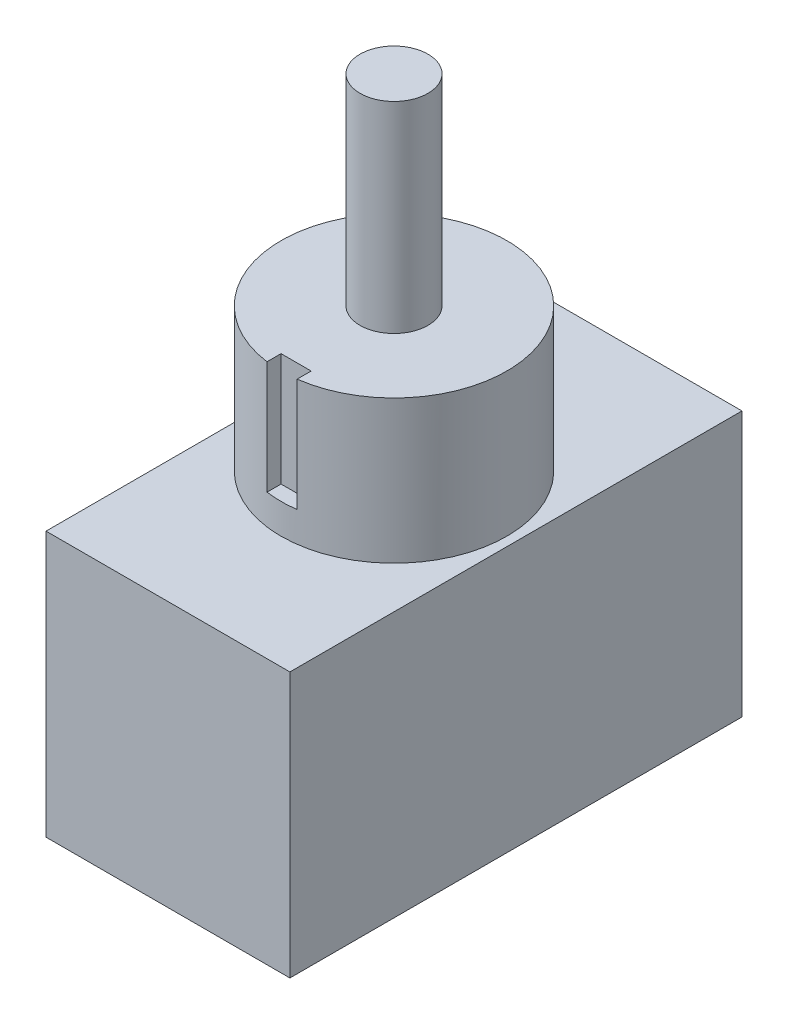
ISO-10303-21;
HEADER;
FILE_DESCRIPTION(('STEP AP214'),'2;1');
FILE_NAME('part.step','',(''),(''),'','','');
FILE_SCHEMA(('AUTOMOTIVE_DESIGN { 1 0 10303 214 1 1 1 1 }'));
ENDSEC;
DATA;
#1=APPLICATION_CONTEXT('core data for automotive mechanical design processes');
#2=APPLICATION_PROTOCOL_DEFINITION('international standard','automotive_design',2000,#1);
#3=PRODUCT_CONTEXT('',#1,'mechanical');
#4=PRODUCT('Part','Part','',(#3));
#5=PRODUCT_RELATED_PRODUCT_CATEGORY('part','',(#4));
#6=PRODUCT_DEFINITION_FORMATION('','',#4);
#7=PRODUCT_DEFINITION_CONTEXT('part definition',#1,'design');
#8=PRODUCT_DEFINITION('design','',#6,#7);
#9=PRODUCT_DEFINITION_SHAPE('','',#8);
#10=(LENGTH_UNIT() NAMED_UNIT(*) SI_UNIT(.MILLI.,.METRE.));
#11=(NAMED_UNIT(*) PLANE_ANGLE_UNIT() SI_UNIT($,.RADIAN.));
#12=(NAMED_UNIT(*) SI_UNIT($,.STERADIAN.) SOLID_ANGLE_UNIT());
#13=UNCERTAINTY_MEASURE_WITH_UNIT(LENGTH_MEASURE(1.E-05),#10,'distance_accuracy_value','');
#14=(GEOMETRIC_REPRESENTATION_CONTEXT(3) GLOBAL_UNCERTAINTY_ASSIGNED_CONTEXT((#13)) GLOBAL_UNIT_ASSIGNED_CONTEXT((#10,
#11,#12)) REPRESENTATION_CONTEXT('',''));
#15=CARTESIAN_POINT('',(0.,0.,0.));
#16=DIRECTION('',(0.,0.,1.));
#17=DIRECTION('',(1.,0.,0.));
#18=AXIS2_PLACEMENT_3D('',#15,#16,#17);
#19=CARTESIAN_POINT('',(-14.8395327202065,13.97,-10.2471837837838));
#20=DIRECTION('',(1.,0.,0.));
#21=DIRECTION('',(0.,0.,-1.));
#22=AXIS2_PLACEMENT_3D('',#19,#20,#21);
#23=PLANE('',#22);
#24=DIRECTION('',(0.,0.,1.));
#25=VECTOR('',#24,1.);
#26=CARTESIAN_POINT('',(-14.8395327202065,0.,-10.2471837837838));
#27=LINE('',#26,#25);
#28=CARTESIAN_POINT('',(-14.8395327202065,0.,-10.2471837837838));
#29=VERTEX_POINT('',#28);
#30=CARTESIAN_POINT('',(-14.8395327202065,0.,13.5780162162162));
#31=VERTEX_POINT('',#30);
#32=EDGE_CURVE('E158',#29,#31,#27,.T.);
#33=ORIENTED_EDGE('',*,*,#32,.T.);
#34=DIRECTION('',(0.,-1.,0.));
#35=VECTOR('',#34,1.);
#36=CARTESIAN_POINT('',(-14.8395327202065,13.97,13.5780162162162));
#37=LINE('',#36,#35);
#38=CARTESIAN_POINT('',(-14.8395327202065,13.97,13.5780162162162));
#39=VERTEX_POINT('',#38);
#40=EDGE_CURVE('E162',#39,#31,#37,.T.);
#41=ORIENTED_EDGE('',*,*,#40,.F.);
#42=DIRECTION('',(0.,0.,1.));
#43=VECTOR('',#42,1.);
#44=CARTESIAN_POINT('',(-14.8395327202065,13.97,-10.2471837837838));
#45=LINE('',#44,#43);
#46=CARTESIAN_POINT('',(-14.8395327202065,13.97,-10.2471837837838));
#47=VERTEX_POINT('',#46);
#48=EDGE_CURVE('E163',#47,#39,#45,.T.);
#49=ORIENTED_EDGE('',*,*,#48,.F.);
#50=DIRECTION('',(0.,-1.,0.));
#51=VECTOR('',#50,1.);
#52=CARTESIAN_POINT('',(-14.8395327202065,13.97,-10.2471837837838));
#53=LINE('',#52,#51);
#54=EDGE_CURVE('E173',#47,#29,#53,.T.);
#55=ORIENTED_EDGE('',*,*,#54,.T.);
#56=EDGE_LOOP('',(#33,#41,#49,#55));
#57=FACE_BOUND('',#56,.T.);
#58=ADVANCED_FACE('F42',(#57),#23,.F.);
#59=CARTESIAN_POINT('',(-14.8395327202065,13.97,13.5780162162162));
#60=DIRECTION('',(0.,0.,-1.));
#61=DIRECTION('',(-1.,0.,0.));
#62=AXIS2_PLACEMENT_3D('',#59,#60,#61);
#63=PLANE('',#62);
#64=DIRECTION('',(1.,0.,0.));
#65=VECTOR('',#64,1.);
#66=CARTESIAN_POINT('',(-14.8395327202065,0.,13.5780162162162));
#67=LINE('',#66,#65);
#68=CARTESIAN_POINT('',(-1.98713272020646,0.,13.5780162162162));
#69=VERTEX_POINT('',#68);
#70=EDGE_CURVE('E177',#31,#69,#67,.T.);
#71=ORIENTED_EDGE('',*,*,#70,.T.);
#72=DIRECTION('',(0.,-1.,0.));
#73=VECTOR('',#72,1.);
#74=CARTESIAN_POINT('',(-1.98713272020646,13.97,13.5780162162162));
#75=LINE('',#74,#73);
#76=CARTESIAN_POINT('',(-1.98713272020646,13.97,13.5780162162162));
#77=VERTEX_POINT('',#76);
#78=EDGE_CURVE('E190',#77,#69,#75,.T.);
#79=ORIENTED_EDGE('',*,*,#78,.F.);
#80=DIRECTION('',(1.,0.,0.));
#81=VECTOR('',#80,1.);
#82=CARTESIAN_POINT('',(-14.8395327202065,13.97,13.5780162162162));
#83=LINE('',#82,#81);
#84=EDGE_CURVE('E95',#39,#77,#83,.T.);
#85=ORIENTED_EDGE('',*,*,#84,.F.);
#86=ORIENTED_EDGE('',*,*,#40,.T.);
#87=EDGE_LOOP('',(#71,#79,#85,#86));
#88=FACE_BOUND('',#87,.T.);
#89=ADVANCED_FACE('F196',(#88),#63,.F.);
#90=CARTESIAN_POINT('',(-1.98713272020647,13.97,-10.2471837837838));
#91=DIRECTION('',(-1.,0.,0.));
#92=DIRECTION('',(0.,0.,1.));
#93=AXIS2_PLACEMENT_3D('',#90,#91,#92);
#94=PLANE('',#93);
#95=DIRECTION('',(0.,0.,-1.));
#96=VECTOR('',#95,1.);
#97=CARTESIAN_POINT('',(-1.98713272020647,0.,-10.2471837837838));
#98=LINE('',#97,#96);
#99=CARTESIAN_POINT('',(-1.98713272020647,0.,-10.2471837837838));
#100=VERTEX_POINT('',#99);
#101=EDGE_CURVE('E180',#69,#100,#98,.T.);
#102=ORIENTED_EDGE('',*,*,#101,.T.);
#103=DIRECTION('',(0.,-1.,0.));
#104=VECTOR('',#103,1.);
#105=CARTESIAN_POINT('',(-1.98713272020647,13.97,-10.2471837837838));
#106=LINE('',#105,#104);
#107=CARTESIAN_POINT('',(-1.98713272020647,13.97,-10.2471837837838));
#108=VERTEX_POINT('',#107);
#109=EDGE_CURVE('E187',#108,#100,#106,.T.);
#110=ORIENTED_EDGE('',*,*,#109,.F.);
#111=DIRECTION('',(0.,0.,-1.));
#112=VECTOR('',#111,1.);
#113=CARTESIAN_POINT('',(-1.98713272020647,13.97,-10.2471837837838));
#114=LINE('',#113,#112);
#115=EDGE_CURVE('E168',#77,#108,#114,.T.);
#116=ORIENTED_EDGE('',*,*,#115,.F.);
#117=ORIENTED_EDGE('',*,*,#78,.T.);
#118=EDGE_LOOP('',(#102,#110,#116,#117));
#119=FACE_BOUND('',#118,.T.);
#120=ADVANCED_FACE('F205',(#119),#94,.F.);
#121=CARTESIAN_POINT('',(-14.8395327202065,13.97,-10.2471837837838));
#122=DIRECTION('',(0.,0.,1.));
#123=DIRECTION('',(1.,0.,0.));
#124=AXIS2_PLACEMENT_3D('',#121,#122,#123);
#125=PLANE('',#124);
#126=DIRECTION('',(-1.,0.,0.));
#127=VECTOR('',#126,1.);
#128=CARTESIAN_POINT('',(-14.8395327202065,0.,-10.2471837837838));
#129=LINE('',#128,#127);
#130=EDGE_CURVE('E87',#100,#29,#129,.T.);
#131=ORIENTED_EDGE('',*,*,#130,.T.);
#132=ORIENTED_EDGE('',*,*,#54,.F.);
#133=DIRECTION('',(-1.,0.,0.));
#134=VECTOR('',#133,1.);
#135=CARTESIAN_POINT('',(-14.8395327202065,13.97,-10.2471837837838));
#136=LINE('',#135,#134);
#137=EDGE_CURVE('E66',#108,#47,#136,.T.);
#138=ORIENTED_EDGE('',*,*,#137,.F.);
#139=ORIENTED_EDGE('',*,*,#109,.T.);
#140=EDGE_LOOP('',(#131,#132,#138,#139));
#141=FACE_BOUND('',#140,.T.);
#142=ADVANCED_FACE('F207',(#141),#125,.F.);
#143=CARTESIAN_POINT('',(0.,13.97,0.));
#144=DIRECTION('',(0.,1.,0.));
#145=DIRECTION('',(0.,0.,1.));
#146=AXIS2_PLACEMENT_3D('',#143,#144,#145);
#147=PLANE('',#146);
#148=CARTESIAN_POINT('',(-8.41333272020647,13.97,1.66541621621622));
#149=DIRECTION('',(0.,1.,0.));
#150=DIRECTION('',(0.,0.,1.));
#151=AXIS2_PLACEMENT_3D('',#148,#149,#150);
#152=CIRCLE('',#151,5.953125);
#153=CARTESIAN_POINT('',(-8.41333272020647,13.97,7.61854121621622));
#154=VERTEX_POINT('',#153);
#155=EDGE_CURVE('E123',#154,#154,#152,.T.);
#156=ORIENTED_EDGE('',*,*,#155,.F.);
#157=EDGE_LOOP('',(#156));
#158=FACE_BOUND('',#157,.T.);
#159=ORIENTED_EDGE('',*,*,#48,.T.);
#160=ORIENTED_EDGE('',*,*,#84,.T.);
#161=ORIENTED_EDGE('',*,*,#115,.T.);
#162=ORIENTED_EDGE('',*,*,#137,.T.);
#163=EDGE_LOOP('',(#159,#160,#161,#162));
#164=FACE_BOUND('',#163,.T.);
#165=ADVANCED_FACE('F208',(#158,#164),#147,.T.);
#166=CARTESIAN_POINT('',(0.,0.,0.));
#167=DIRECTION('',(0.,1.,0.));
#168=DIRECTION('',(0.,0.,1.));
#169=AXIS2_PLACEMENT_3D('',#166,#167,#168);
#170=PLANE('',#169);
#171=ORIENTED_EDGE('',*,*,#32,.F.);
#172=ORIENTED_EDGE('',*,*,#130,.F.);
#173=ORIENTED_EDGE('',*,*,#101,.F.);
#174=ORIENTED_EDGE('',*,*,#70,.F.);
#175=EDGE_LOOP('',(#171,#172,#173,#174));
#176=FACE_BOUND('',#175,.T.);
#177=ADVANCED_FACE('F201',(#176),#170,.F.);
#178=CARTESIAN_POINT('',(-8.41333272020647,21.510625,1.66541621621622));
#179=DIRECTION('',(0.,-1.,0.));
#180=DIRECTION('',(0.,0.,-1.));
#181=AXIS2_PLACEMENT_3D('',#178,#179,#180);
#182=CYLINDRICAL_SURFACE('',#181,5.953125);
#183=CARTESIAN_POINT('',(-8.41333272020647,15.5575,1.66541621621622));
#184=DIRECTION('',(0.,1.,0.));
#185=DIRECTION('',(0.,0.,1.));
#186=AXIS2_PLACEMENT_3D('',#183,#184,#185);
#187=CIRCLE('',#186,5.953125);
#188=CARTESIAN_POINT('',(-9.20708272020646,15.5575,7.56538725030825));
#189=VERTEX_POINT('',#188);
#190=CARTESIAN_POINT('',(-7.61958272020647,15.5575,7.56538725030825));
#191=VERTEX_POINT('',#190);
#192=EDGE_CURVE('E13',#189,#191,#187,.T.);
#193=ORIENTED_EDGE('',*,*,#192,.F.);
#194=DIRECTION('',(0.,-1.,0.));
#195=VECTOR('',#194,1.);
#196=CARTESIAN_POINT('',(-9.20708272020646,21.510625,7.56538725030825));
#197=LINE('',#196,#195);
#198=CARTESIAN_POINT('',(-9.20708272020646,21.510625,7.56538725030825));
#199=VERTEX_POINT('',#198);
#200=EDGE_CURVE('E150',#189,#199,#197,.F.);
#201=ORIENTED_EDGE('',*,*,#200,.T.);
#202=CARTESIAN_POINT('',(-8.41333272020647,21.510625,1.66541621621622));
#203=DIRECTION('',(0.,1.,0.));
#204=DIRECTION('',(0.,0.,1.));
#205=AXIS2_PLACEMENT_3D('',#202,#203,#204);
#206=CIRCLE('',#205,5.953125);
#207=CARTESIAN_POINT('',(-7.61958272020647,21.510625,7.56538725030825));
#208=VERTEX_POINT('',#207);
#209=EDGE_CURVE('E155',#208,#199,#206,.T.);
#210=ORIENTED_EDGE('',*,*,#209,.F.);
#211=DIRECTION('',(0.,-1.,0.));
#212=VECTOR('',#211,1.);
#213=CARTESIAN_POINT('',(-7.61958272020647,21.510625,7.56538725030825));
#214=LINE('',#213,#212);
#215=EDGE_CURVE('E57',#208,#191,#214,.T.);
#216=ORIENTED_EDGE('',*,*,#215,.T.);
#217=EDGE_LOOP('',(#193,#201,#210,#216));
#218=FACE_BOUND('',#217,.T.);
#219=ORIENTED_EDGE('',*,*,#155,.T.);
#220=EDGE_LOOP('',(#219));
#221=FACE_BOUND('',#220,.T.);
#222=ADVANCED_FACE('F216',(#218,#221),#182,.T.);
#223=CARTESIAN_POINT('',(-8.41333272020647,21.510625,1.66541621621622));
#224=DIRECTION('',(0.,1.,0.));
#225=DIRECTION('',(0.,0.,1.));
#226=AXIS2_PLACEMENT_3D('',#223,#224,#225);
#227=PLANE('',#226);
#228=CARTESIAN_POINT('',(-8.41333272020647,21.510625,1.66541621621622));
#229=DIRECTION('',(0.,1.,0.));
#230=DIRECTION('',(0.,0.,1.));
#231=AXIS2_PLACEMENT_3D('',#228,#229,#230);
#232=CIRCLE('',#231,1.79055909454108);
#233=CARTESIAN_POINT('',(-8.41333272020647,21.510625,3.4559753107573));
#234=VERTEX_POINT('',#233);
#235=EDGE_CURVE('E325',#234,#234,#232,.T.);
#236=ORIENTED_EDGE('',*,*,#235,.F.);
#237=EDGE_LOOP('',(#236));
#238=FACE_BOUND('',#237,.T.);
#239=DIRECTION('',(0.,0.,1.));
#240=VECTOR('',#239,1.);
#241=CARTESIAN_POINT('',(-9.20708272020646,21.510625,6.82479121621622));
#242=LINE('',#241,#240);
#243=CARTESIAN_POINT('',(-9.20708272020646,21.510625,6.82479121621622));
#244=VERTEX_POINT('',#243);
#245=EDGE_CURVE('E137',#244,#199,#242,.T.);
#246=ORIENTED_EDGE('',*,*,#245,.F.);
#247=DIRECTION('',(-1.,0.,0.));
#248=VECTOR('',#247,1.);
#249=CARTESIAN_POINT('',(-9.20708272020646,21.510625,6.82479121621622));
#250=LINE('',#249,#248);
#251=CARTESIAN_POINT('',(-7.61958272020647,21.510625,6.82479121621622));
#252=VERTEX_POINT('',#251);
#253=EDGE_CURVE('E128',#252,#244,#250,.T.);
#254=ORIENTED_EDGE('',*,*,#253,.F.);
#255=DIRECTION('',(0.,0.,-1.));
#256=VECTOR('',#255,1.);
#257=CARTESIAN_POINT('',(-7.61958272020647,21.510625,1.66541621621622));
#258=LINE('',#257,#256);
#259=EDGE_CURVE('E50',#208,#252,#258,.T.);
#260=ORIENTED_EDGE('',*,*,#259,.F.);
#261=ORIENTED_EDGE('',*,*,#209,.T.);
#262=EDGE_LOOP('',(#246,#254,#260,#261));
#263=FACE_BOUND('',#262,.T.);
#264=ADVANCED_FACE('F136',(#238,#263),#227,.T.);
#265=CARTESIAN_POINT('',(0.,15.5575,0.));
#266=DIRECTION('',(0.,1.,0.));
#267=DIRECTION('',(0.,0.,1.));
#268=AXIS2_PLACEMENT_3D('',#265,#266,#267);
#269=PLANE('',#268);
#270=ORIENTED_EDGE('',*,*,#192,.T.);
#271=DIRECTION('',(0.,0.,1.));
#272=VECTOR('',#271,1.);
#273=CARTESIAN_POINT('',(-7.61958272020647,15.5575,6.82479121621622));
#274=LINE('',#273,#272);
#275=CARTESIAN_POINT('',(-7.61958272020647,15.5575,6.82479121621622));
#276=VERTEX_POINT('',#275);
#277=EDGE_CURVE('E146',#276,#191,#274,.T.);
#278=ORIENTED_EDGE('',*,*,#277,.F.);
#279=DIRECTION('',(1.,0.,0.));
#280=VECTOR('',#279,1.);
#281=CARTESIAN_POINT('',(-9.20708272020646,15.5575,6.82479121621622));
#282=LINE('',#281,#280);
#283=CARTESIAN_POINT('',(-9.20708272020646,15.5575,6.82479121621622));
#284=VERTEX_POINT('',#283);
#285=EDGE_CURVE('E131',#284,#276,#282,.T.);
#286=ORIENTED_EDGE('',*,*,#285,.F.);
#287=DIRECTION('',(0.,0.,-1.));
#288=VECTOR('',#287,1.);
#289=CARTESIAN_POINT('',(-9.20708272020646,15.5575,6.82479121621622));
#290=LINE('',#289,#288);
#291=EDGE_CURVE('E151',#189,#284,#290,.T.);
#292=ORIENTED_EDGE('',*,*,#291,.F.);
#293=EDGE_LOOP('',(#270,#278,#286,#292));
#294=FACE_BOUND('',#293,.T.);
#295=ADVANCED_FACE('F260',(#294),#269,.T.);
#296=CARTESIAN_POINT('',(-9.20708272020646,12.1951210428595,6.82479121621622));
#297=DIRECTION('',(-1.,0.,0.));
#298=DIRECTION('',(0.,0.,1.));
#299=AXIS2_PLACEMENT_3D('',#296,#297,#298);
#300=PLANE('',#299);
#301=ORIENTED_EDGE('',*,*,#291,.T.);
#302=DIRECTION('',(0.,1.,0.));
#303=VECTOR('',#302,1.);
#304=CARTESIAN_POINT('',(-9.20708272020646,12.1951210428595,6.82479121621622));
#305=LINE('',#304,#303);
#306=EDGE_CURVE('E134',#284,#244,#305,.T.);
#307=ORIENTED_EDGE('',*,*,#306,.T.);
#308=ORIENTED_EDGE('',*,*,#245,.T.);
#309=ORIENTED_EDGE('',*,*,#200,.F.);
#310=EDGE_LOOP('',(#301,#307,#308,#309));
#311=FACE_BOUND('',#310,.T.);
#312=ADVANCED_FACE('F265',(#311),#300,.F.);
#313=CARTESIAN_POINT('',(-7.61958272020647,12.1951210428595,6.82479121621622));
#314=DIRECTION('',(1.,0.,0.));
#315=DIRECTION('',(0.,0.,-1.));
#316=AXIS2_PLACEMENT_3D('',#313,#314,#315);
#317=PLANE('',#316);
#318=ORIENTED_EDGE('',*,*,#259,.T.);
#319=DIRECTION('',(0.,1.,0.));
#320=VECTOR('',#319,1.);
#321=CARTESIAN_POINT('',(-7.61958272020647,12.1951210428595,6.82479121621622));
#322=LINE('',#321,#320);
#323=EDGE_CURVE('E117',#276,#252,#322,.T.);
#324=ORIENTED_EDGE('',*,*,#323,.F.);
#325=ORIENTED_EDGE('',*,*,#277,.T.);
#326=ORIENTED_EDGE('',*,*,#215,.F.);
#327=EDGE_LOOP('',(#318,#324,#325,#326));
#328=FACE_BOUND('',#327,.T.);
#329=ADVANCED_FACE('F116',(#328),#317,.F.);
#330=CARTESIAN_POINT('',(-9.20708272020646,12.1951210428595,6.82479121621622));
#331=DIRECTION('',(0.,0.,-1.));
#332=DIRECTION('',(-1.,0.,0.));
#333=AXIS2_PLACEMENT_3D('',#330,#331,#332);
#334=PLANE('',#333);
#335=ORIENTED_EDGE('',*,*,#285,.T.);
#336=ORIENTED_EDGE('',*,*,#323,.T.);
#337=ORIENTED_EDGE('',*,*,#253,.T.);
#338=ORIENTED_EDGE('',*,*,#306,.F.);
#339=EDGE_LOOP('',(#335,#336,#337,#338));
#340=FACE_BOUND('',#339,.T.);
#341=ADVANCED_FACE('F126',(#340),#334,.F.);
#342=CARTESIAN_POINT('',(-8.41333272020647,32.102425,1.66541621621622));
#343=DIRECTION('',(0.,-1.,0.));
#344=DIRECTION('',(0.,0.,-1.));
#345=AXIS2_PLACEMENT_3D('',#342,#343,#344);
#346=CYLINDRICAL_SURFACE('',#345,1.79055909454108);
#347=CARTESIAN_POINT('',(-8.41333272020647,32.102425,1.66541621621622));
#348=DIRECTION('',(0.,1.,0.));
#349=DIRECTION('',(0.,0.,1.));
#350=AXIS2_PLACEMENT_3D('',#347,#348,#349);
#351=CIRCLE('',#350,1.79055909454108);
#352=CARTESIAN_POINT('',(-8.41333272020647,32.102425,3.4559753107573));
#353=VERTEX_POINT('',#352);
#354=EDGE_CURVE('E141',#353,#353,#351,.T.);
#355=ORIENTED_EDGE('',*,*,#354,.F.);
#356=EDGE_LOOP('',(#355));
#357=FACE_BOUND('',#356,.T.);
#358=ORIENTED_EDGE('',*,*,#235,.T.);
#359=EDGE_LOOP('',(#358));
#360=FACE_BOUND('',#359,.T.);
#361=ADVANCED_FACE('F292',(#357,#360),#346,.T.);
#362=CARTESIAN_POINT('',(-8.41333272020647,32.102425,1.66541621621622));
#363=DIRECTION('',(0.,1.,0.));
#364=DIRECTION('',(0.,0.,1.));
#365=AXIS2_PLACEMENT_3D('',#362,#363,#364);
#366=PLANE('',#365);
#367=ORIENTED_EDGE('',*,*,#354,.T.);
#368=EDGE_LOOP('',(#367));
#369=FACE_BOUND('',#368,.T.);
#370=ADVANCED_FACE('F308',(#369),#366,.T.);
#371=CLOSED_SHELL('',(#58,#89,#120,#142,#165,#177,#222,#264,#295,#312,#329,#341,#361,#370));
#372=MANIFOLD_SOLID_BREP('B2',#371);
#373=ADVANCED_BREP_SHAPE_REPRESENTATION('',(#18,#372),#14);
#374=SHAPE_DEFINITION_REPRESENTATION(#9,#373);
ENDSEC;
END-ISO-10303-21;
